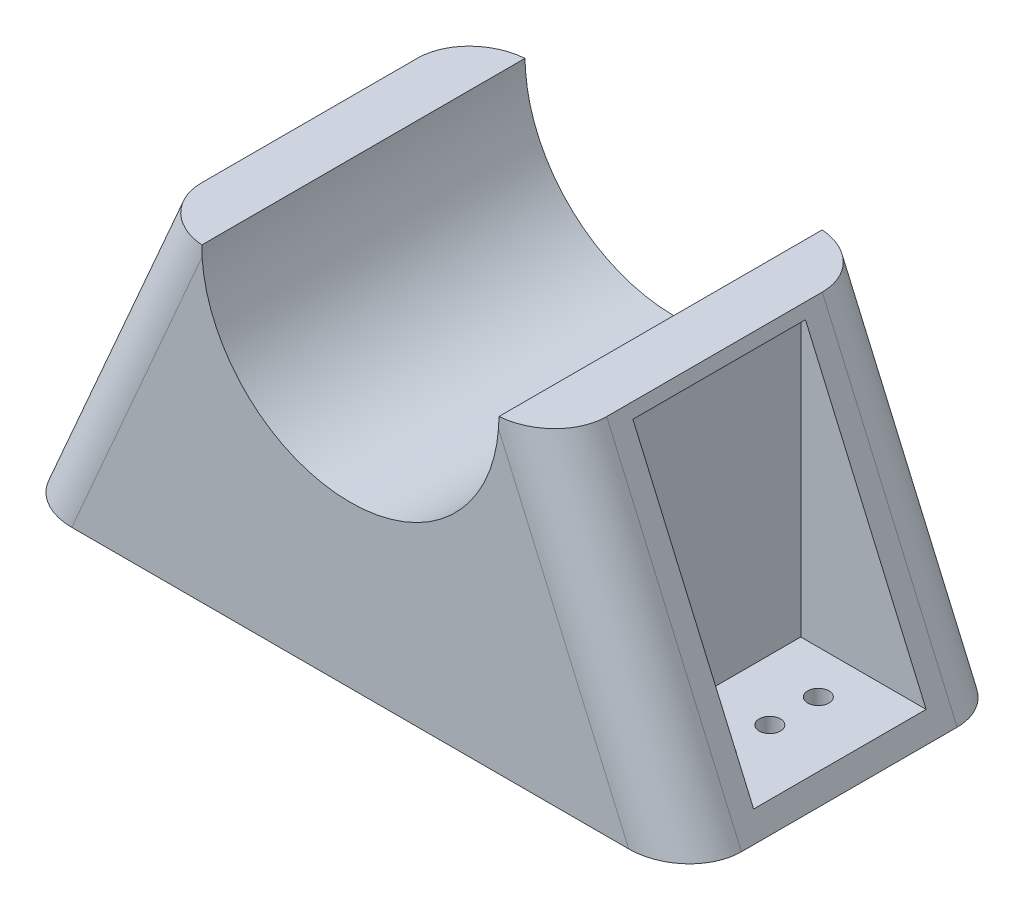
ISO-10303-21;
HEADER;
FILE_DESCRIPTION(('STEP AP214'),'2;1');
FILE_NAME('part.step','',(''),(''),'','','');
FILE_SCHEMA(('AUTOMOTIVE_DESIGN { 1 0 10303 214 1 1 1 1 }'));
ENDSEC;
DATA;
#1=APPLICATION_CONTEXT('core data for automotive mechanical design processes');
#2=APPLICATION_PROTOCOL_DEFINITION('international standard','automotive_design',2000,#1);
#3=PRODUCT_CONTEXT('',#1,'mechanical');
#4=PRODUCT('Part','Part','',(#3));
#5=PRODUCT_RELATED_PRODUCT_CATEGORY('part','',(#4));
#6=PRODUCT_DEFINITION_FORMATION('','',#4);
#7=PRODUCT_DEFINITION_CONTEXT('part definition',#1,'design');
#8=PRODUCT_DEFINITION('design','',#6,#7);
#9=PRODUCT_DEFINITION_SHAPE('','',#8);
#10=(LENGTH_UNIT() NAMED_UNIT(*) SI_UNIT(.MILLI.,.METRE.));
#11=(NAMED_UNIT(*) PLANE_ANGLE_UNIT() SI_UNIT($,.RADIAN.));
#12=(NAMED_UNIT(*) SI_UNIT($,.STERADIAN.) SOLID_ANGLE_UNIT());
#13=UNCERTAINTY_MEASURE_WITH_UNIT(LENGTH_MEASURE(1.E-05),#10,'distance_accuracy_value','');
#14=(GEOMETRIC_REPRESENTATION_CONTEXT(3) GLOBAL_UNCERTAINTY_ASSIGNED_CONTEXT((#13)) GLOBAL_UNIT_ASSIGNED_CONTEXT((#10,
#11,#12)) REPRESENTATION_CONTEXT('',''));
#15=CARTESIAN_POINT('',(0.,0.,0.));
#16=DIRECTION('',(0.,0.,1.));
#17=DIRECTION('',(1.,0.,0.));
#18=AXIS2_PLACEMENT_3D('',#15,#16,#17);
#19=CARTESIAN_POINT('',(-47.7,0.,76.2));
#20=DIRECTION('',(-0.91683450428211,0.399267443899171,0.));
#21=DIRECTION('',(-0.399267443899171,-0.91683450428211,0.));
#22=AXIS2_PLACEMENT_3D('',#19,#20,#21);
#23=PLANE('',#22);
#24=DIRECTION('',(0.,0.,-1.));
#25=VECTOR('',#24,1.);
#26=CARTESIAN_POINT('',(-79.45,-72.9072604234373,76.2));
#27=LINE('',#26,#25);
#28=CARTESIAN_POINT('',(-79.45,-72.9072604234373,63.5));
#29=VERTEX_POINT('',#28);
#30=CARTESIAN_POINT('',(-79.45,-72.9072604234373,12.7));
#31=VERTEX_POINT('',#30);
#32=EDGE_CURVE('E177',#29,#31,#27,.T.);
#33=ORIENTED_EDGE('',*,*,#32,.F.);
#34=DIRECTION('',(0.399267443899171,0.91683450428211,0.));
#35=VECTOR('',#34,1.);
#36=CARTESIAN_POINT('',(-47.7,0.,63.5));
#37=LINE('',#36,#35);
#38=CARTESIAN_POINT('',(-47.7,0.,63.5));
#39=VERTEX_POINT('',#38);
#40=EDGE_CURVE('E439',#29,#39,#37,.T.);
#41=ORIENTED_EDGE('',*,*,#40,.T.);
#42=DIRECTION('',(0.,0.,-1.));
#43=VECTOR('',#42,1.);
#44=CARTESIAN_POINT('',(-47.7,0.,76.2));
#45=LINE('',#44,#43);
#46=CARTESIAN_POINT('',(-47.7,0.,12.7));
#47=VERTEX_POINT('',#46);
#48=EDGE_CURVE('E246',#47,#39,#45,.F.);
#49=ORIENTED_EDGE('',*,*,#48,.F.);
#50=DIRECTION('',(0.399267443899171,0.91683450428211,0.));
#51=VECTOR('',#50,1.);
#52=CARTESIAN_POINT('',(-79.45,-72.9072604234373,12.7));
#53=LINE('',#52,#51);
#54=EDGE_CURVE('E437',#47,#31,#53,.F.);
#55=ORIENTED_EDGE('',*,*,#54,.T.);
#56=EDGE_LOOP('',(#33,#41,#49,#55));
#57=FACE_BOUND('',#56,.T.);
#58=DIRECTION('',(0.,0.,-1.));
#59=VECTOR('',#58,1.);
#60=CARTESIAN_POINT('',(-77.2377374754826,-67.8272604234373,76.2));
#61=LINE('',#60,#59);
#62=CARTESIAN_POINT('',(-77.2377374754826,-67.8272604234373,58.42));
#63=VERTEX_POINT('',#62);
#64=CARTESIAN_POINT('',(-77.2377374754826,-67.8272604234373,17.78));
#65=VERTEX_POINT('',#64);
#66=EDGE_CURVE('E49',#63,#65,#61,.T.);
#67=ORIENTED_EDGE('',*,*,#66,.T.);
#68=DIRECTION('',(0.399267443899171,0.91683450428211,0.));
#69=VECTOR('',#68,1.);
#70=CARTESIAN_POINT('',(-47.7,0.,17.78));
#71=LINE('',#70,#69);
#72=CARTESIAN_POINT('',(-48.8061312622587,-2.54,17.78));
#73=VERTEX_POINT('',#72);
#74=EDGE_CURVE('E11',#65,#73,#71,.T.);
#75=ORIENTED_EDGE('',*,*,#74,.T.);
#76=DIRECTION('',(0.,0.,1.));
#77=VECTOR('',#76,1.);
#78=CARTESIAN_POINT('',(-48.8061312622587,-2.54,76.2));
#79=LINE('',#78,#77);
#80=CARTESIAN_POINT('',(-48.8061312622587,-2.54,58.42));
#81=VERTEX_POINT('',#80);
#82=EDGE_CURVE('E333',#73,#81,#79,.T.);
#83=ORIENTED_EDGE('',*,*,#82,.T.);
#84=DIRECTION('',(-0.399267443899171,-0.91683450428211,0.));
#85=VECTOR('',#84,1.);
#86=CARTESIAN_POINT('',(-47.7,0.,58.42));
#87=LINE('',#86,#85);
#88=EDGE_CURVE('E336',#81,#63,#87,.T.);
#89=ORIENTED_EDGE('',*,*,#88,.T.);
#90=EDGE_LOOP('',(#67,#75,#83,#89));
#91=FACE_BOUND('',#90,.T.);
#92=ADVANCED_FACE('F39',(#57,#91),#23,.T.);
#93=CARTESIAN_POINT('',(79.45,-72.9072604234373,76.2));
#94=DIRECTION('',(0.91683450428211,0.399267443899171,0.));
#95=DIRECTION('',(-0.399267443899171,0.91683450428211,0.));
#96=AXIS2_PLACEMENT_3D('',#93,#94,#95);
#97=PLANE('',#96);
#98=DIRECTION('',(0.,0.,-1.));
#99=VECTOR('',#98,1.);
#100=CARTESIAN_POINT('',(79.45,-72.9072604234373,76.2));
#101=LINE('',#100,#99);
#102=CARTESIAN_POINT('',(79.45,-72.9072604234373,63.5));
#103=VERTEX_POINT('',#102);
#104=CARTESIAN_POINT('',(79.45,-72.9072604234373,12.7));
#105=VERTEX_POINT('',#104);
#106=EDGE_CURVE('E239',#103,#105,#101,.T.);
#107=ORIENTED_EDGE('',*,*,#106,.T.);
#108=DIRECTION('',(0.399267443899171,-0.91683450428211,0.));
#109=VECTOR('',#108,1.);
#110=CARTESIAN_POINT('',(47.7,0.,12.7));
#111=LINE('',#110,#109);
#112=CARTESIAN_POINT('',(47.7,0.,12.7));
#113=VERTEX_POINT('',#112);
#114=EDGE_CURVE('E273',#105,#113,#111,.F.);
#115=ORIENTED_EDGE('',*,*,#114,.T.);
#116=DIRECTION('',(0.,0.,-1.));
#117=VECTOR('',#116,1.);
#118=CARTESIAN_POINT('',(47.7,0.,76.2));
#119=LINE('',#118,#117);
#120=CARTESIAN_POINT('',(47.7,0.,63.5));
#121=VERTEX_POINT('',#120);
#122=EDGE_CURVE('E250',#121,#113,#119,.T.);
#123=ORIENTED_EDGE('',*,*,#122,.F.);
#124=DIRECTION('',(0.399267443899171,-0.91683450428211,0.));
#125=VECTOR('',#124,1.);
#126=CARTESIAN_POINT('',(79.45,-72.9072604234373,63.5));
#127=LINE('',#126,#125);
#128=EDGE_CURVE('E270',#121,#103,#127,.T.);
#129=ORIENTED_EDGE('',*,*,#128,.T.);
#130=EDGE_LOOP('',(#107,#115,#123,#129));
#131=FACE_BOUND('',#130,.T.);
#132=DIRECTION('',(-0.399267443899171,0.91683450428211,0.));
#133=VECTOR('',#132,1.);
#134=CARTESIAN_POINT('',(79.45,-72.9072604234373,58.42));
#135=LINE('',#134,#133);
#136=CARTESIAN_POINT('',(77.2377374754826,-67.8272604234373,58.42));
#137=VERTEX_POINT('',#136);
#138=CARTESIAN_POINT('',(48.8061312622587,-2.53999999999999,58.42));
#139=VERTEX_POINT('',#138);
#140=EDGE_CURVE('E446',#137,#139,#135,.T.);
#141=ORIENTED_EDGE('',*,*,#140,.T.);
#142=DIRECTION('',(0.,0.,-1.));
#143=VECTOR('',#142,1.);
#144=CARTESIAN_POINT('',(48.8061312622587,-2.54000000000001,76.2));
#145=LINE('',#144,#143);
#146=CARTESIAN_POINT('',(48.8061312622587,-2.53999999999997,17.78));
#147=VERTEX_POINT('',#146);
#148=EDGE_CURVE('E442',#139,#147,#145,.T.);
#149=ORIENTED_EDGE('',*,*,#148,.T.);
#150=DIRECTION('',(0.399267443899171,-0.91683450428211,0.));
#151=VECTOR('',#150,1.);
#152=CARTESIAN_POINT('',(79.45,-72.9072604234373,17.78));
#153=LINE('',#152,#151);
#154=CARTESIAN_POINT('',(77.2377374754826,-67.8272604234373,17.78));
#155=VERTEX_POINT('',#154);
#156=EDGE_CURVE('E474',#147,#155,#153,.T.);
#157=ORIENTED_EDGE('',*,*,#156,.T.);
#158=DIRECTION('',(0.,0.,1.));
#159=VECTOR('',#158,1.);
#160=CARTESIAN_POINT('',(77.2377374754826,-67.8272604234373,76.2));
#161=LINE('',#160,#159);
#162=EDGE_CURVE('E476',#155,#137,#161,.T.);
#163=ORIENTED_EDGE('',*,*,#162,.T.);
#164=EDGE_LOOP('',(#141,#149,#157,#163));
#165=FACE_BOUND('',#164,.T.);
#166=ADVANCED_FACE('F370',(#131,#165),#97,.T.);
#167=CARTESIAN_POINT('',(-50.9776999532329,0.,269.88450505913));
#168=DIRECTION('',(0.,1.,0.));
#169=DIRECTION('',(0.,0.,1.));
#170=AXIS2_PLACEMENT_3D('',#167,#168,#169);
#171=PLANE('',#170);
#172=ORIENTED_EDGE('',*,*,#122,.T.);
#173=CARTESIAN_POINT('',(33.8479907871223,0.,12.7));
#174=DIRECTION('',(0.,1.,0.));
#175=DIRECTION('',(-1.,0.,0.));
#176=AXIS2_PLACEMENT_3D('',#173,#174,#175);
#177=ELLIPSE('',#176,13.8520092128778,12.7);
#178=CARTESIAN_POINT('',(35.,0.,0.0439959794991136));
#179=VERTEX_POINT('',#178);
#180=EDGE_CURVE('E277',#113,#179,#177,.T.);
#181=ORIENTED_EDGE('',*,*,#180,.T.);
#182=DIRECTION('',(0.,0.,-1.));
#183=VECTOR('',#182,1.);
#184=CARTESIAN_POINT('',(35.,0.,76.2));
#185=LINE('',#184,#183);
#186=CARTESIAN_POINT('',(35.,0.,76.1560040205009));
#187=VERTEX_POINT('',#186);
#188=EDGE_CURVE('E260',#187,#179,#185,.T.);
#189=ORIENTED_EDGE('',*,*,#188,.F.);
#190=CARTESIAN_POINT('',(33.8479907871223,0.,63.5));
#191=DIRECTION('',(0.,1.,0.));
#192=DIRECTION('',(1.,0.,0.));
#193=AXIS2_PLACEMENT_3D('',#190,#191,#192);
#194=ELLIPSE('',#193,13.8520092128778,12.7);
#195=EDGE_CURVE('E275',#187,#121,#194,.T.);
#196=ORIENTED_EDGE('',*,*,#195,.T.);
#197=EDGE_LOOP('',(#172,#181,#189,#196));
#198=FACE_BOUND('',#197,.T.);
#199=ADVANCED_FACE('F376',(#198),#171,.T.);
#200=CARTESIAN_POINT('',(0.,0.,76.2));
#201=DIRECTION('',(0.,0.,1.));
#202=DIRECTION('',(1.,0.,0.));
#203=AXIS2_PLACEMENT_3D('',#200,#201,#202);
#204=PLANE('',#203);
#205=CARTESIAN_POINT('',(0.,0.,76.2));
#206=DIRECTION('',(0.,0.,1.));
#207=DIRECTION('',(1.,0.,0.));
#208=AXIS2_PLACEMENT_3D('',#205,#206,#207);
#209=CIRCLE('',#208,35.);
#210=CARTESIAN_POINT('',(-34.9142534289852,-2.44845001921529,76.2));
#211=VERTEX_POINT('',#210);
#212=CARTESIAN_POINT('',(34.9142534289852,-2.44845001921527,76.2));
#213=VERTEX_POINT('',#212);
#214=EDGE_CURVE('E254',#211,#213,#209,.T.);
#215=ORIENTED_EDGE('',*,*,#214,.F.);
#216=DIRECTION('',(0.399267443899171,0.91683450428211,0.));
#217=VECTOR('',#216,1.);
#218=CARTESIAN_POINT('',(-28.4521305387712,12.3904689239371,76.2));
#219=LINE('',#218,#217);
#220=CARTESIAN_POINT('',(-65.5979907871222,-72.9072604234373,76.2));
#221=VERTEX_POINT('',#220);
#222=EDGE_CURVE('E319',#211,#221,#219,.F.);
#223=ORIENTED_EDGE('',*,*,#222,.T.);
#224=DIRECTION('',(-1.,0.,0.));
#225=VECTOR('',#224,1.);
#226=CARTESIAN_POINT('',(0.,-72.9072604234373,76.2));
#227=LINE('',#226,#225);
#228=CARTESIAN_POINT('',(65.5979907871223,-72.9072604234373,76.2));
#229=VERTEX_POINT('',#228);
#230=EDGE_CURVE('E243',#229,#221,#227,.T.);
#231=ORIENTED_EDGE('',*,*,#230,.F.);
#232=DIRECTION('',(0.399267443899171,-0.91683450428211,0.));
#233=VECTOR('',#232,1.);
#234=CARTESIAN_POINT('',(28.4521305387712,12.3904689239371,76.2));
#235=LINE('',#234,#233);
#236=EDGE_CURVE('E470',#229,#213,#235,.F.);
#237=ORIENTED_EDGE('',*,*,#236,.T.);
#238=EDGE_LOOP('',(#215,#223,#231,#237));
#239=FACE_BOUND('',#238,.T.);
#240=ADVANCED_FACE('F417',(#239),#204,.T.);
#241=CARTESIAN_POINT('',(0.,0.,0.));
#242=DIRECTION('',(0.,0.,1.));
#243=DIRECTION('',(1.,0.,0.));
#244=AXIS2_PLACEMENT_3D('',#241,#242,#243);
#245=PLANE('',#244);
#246=DIRECTION('',(-1.,0.,0.));
#247=VECTOR('',#246,1.);
#248=CARTESIAN_POINT('',(0.,-72.9072604234373,0.));
#249=LINE('',#248,#247);
#250=CARTESIAN_POINT('',(65.5979907871223,-72.9072604234373,0.));
#251=VERTEX_POINT('',#250);
#252=CARTESIAN_POINT('',(-65.5979907871223,-72.9072604234373,0.));
#253=VERTEX_POINT('',#252);
#254=EDGE_CURVE('E242',#251,#253,#249,.T.);
#255=ORIENTED_EDGE('',*,*,#254,.T.);
#256=DIRECTION('',(0.399267443899171,0.91683450428211,0.));
#257=VECTOR('',#256,1.);
#258=CARTESIAN_POINT('',(-36.0562017956172,-5.07069653751947,0.));
#259=LINE('',#258,#257);
#260=CARTESIAN_POINT('',(-34.9142534289852,-2.44845001921526,0.));
#261=VERTEX_POINT('',#260);
#262=EDGE_CURVE('E330',#253,#261,#259,.T.);
#263=ORIENTED_EDGE('',*,*,#262,.T.);
#264=CARTESIAN_POINT('',(0.,0.,0.));
#265=DIRECTION('',(0.,0.,1.));
#266=DIRECTION('',(1.,0.,0.));
#267=AXIS2_PLACEMENT_3D('',#264,#265,#266);
#268=CIRCLE('',#267,35.);
#269=CARTESIAN_POINT('',(34.9142534289852,-2.44845001921527,0.));
#270=VERTEX_POINT('',#269);
#271=EDGE_CURVE('E253',#261,#270,#268,.T.);
#272=ORIENTED_EDGE('',*,*,#271,.T.);
#273=DIRECTION('',(0.399267443899171,-0.91683450428211,0.));
#274=VECTOR('',#273,1.);
#275=CARTESIAN_POINT('',(67.8062017956172,-77.9779569609568,0.));
#276=LINE('',#275,#274);
#277=EDGE_CURVE('E263',#270,#251,#276,.T.);
#278=ORIENTED_EDGE('',*,*,#277,.T.);
#279=EDGE_LOOP('',(#255,#263,#272,#278));
#280=FACE_BOUND('',#279,.T.);
#281=ADVANCED_FACE('F422',(#280),#245,.F.);
#282=CARTESIAN_POINT('',(0.,0.,76.2));
#283=DIRECTION('',(0.,0.,-1.));
#284=DIRECTION('',(-1.,0.,0.));
#285=AXIS2_PLACEMENT_3D('',#282,#283,#284);
#286=CYLINDRICAL_SURFACE('',#285,35.);
#287=DIRECTION('',(0.,0.,-1.));
#288=VECTOR('',#287,1.);
#289=CARTESIAN_POINT('',(-35.,0.,76.2));
#290=LINE('',#289,#288);
#291=CARTESIAN_POINT('',(-35.,0.,0.0439959794991396));
#292=VERTEX_POINT('',#291);
#293=CARTESIAN_POINT('',(-35.,0.,76.1560040205009));
#294=VERTEX_POINT('',#293);
#295=EDGE_CURVE('E256',#292,#294,#290,.F.);
#296=ORIENTED_EDGE('',*,*,#295,.T.);
#297=CARTESIAN_POINT('',(-35.,0.,76.1560040205009));
#298=CARTESIAN_POINT('',(-35.0000002493644,-0.204170360994433,76.1628061050153));
#299=CARTESIAN_POINT('',(-34.9982134697961,-0.408363935252036,76.1689545938316));
#300=CARTESIAN_POINT('',(-34.991066692675,-0.816651308872302,76.1797480480713));
#301=CARTESIAN_POINT('',(-34.9857080368486,-1.02074511691312,76.1843935770882));
#302=CARTESIAN_POINT('',(-34.9714183184161,-1.42884099374481,76.1919901940467));
#303=CARTESIAN_POINT('',(-34.9624872412537,-1.63284306215849,76.194941275084));
#304=CARTESIAN_POINT('',(-34.9410511594194,-2.04075450378179,76.1989459800358));
#305=CARTESIAN_POINT('',(-34.9285448137084,-2.24466381340013,76.1999988908854));
#306=CARTESIAN_POINT('',(-34.9142534289852,-2.44845001921529,76.2));
#307=B_SPLINE_CURVE_WITH_KNOTS('',3,(#297,#298,#299,#300,#301,#302,#303,#304,#305,#306),
.UNSPECIFIED.,.F.,.F.,(4,2,2,2,4),(0.,0.612844137490721,1.22545819809104,1.83807475488894,
2.450921398761),.UNSPECIFIED.);
#308=EDGE_CURVE('E312',#294,#211,#307,.T.);
#309=ORIENTED_EDGE('',*,*,#308,.T.);
#310=ORIENTED_EDGE('',*,*,#214,.T.);
#311=CARTESIAN_POINT('',(34.9142534289852,-2.44845001921527,76.2));
#312=CARTESIAN_POINT('',(34.9285448137084,-2.24466381340011,76.1999988908854));
#313=CARTESIAN_POINT('',(34.9410511594194,-2.04075450378177,76.1989459800358));
#314=CARTESIAN_POINT('',(34.9624872412537,-1.63284306215847,76.194941275084));
#315=CARTESIAN_POINT('',(34.9714183184161,-1.4288409937448,76.1919901940467));
#316=CARTESIAN_POINT('',(34.9857080368486,-1.02074511691311,76.1843935770882));
#317=CARTESIAN_POINT('',(34.991066692675,-0.816651308872295,76.1797480480713));
#318=CARTESIAN_POINT('',(34.9982134697961,-0.408363935252032,76.1689545938316));
#319=CARTESIAN_POINT('',(35.0000002493644,-0.20417036099443,76.1628061050153));
#320=CARTESIAN_POINT('',(35.,0.,76.1560040205009));
#321=B_SPLINE_CURVE_WITH_KNOTS('',3,(#311,#312,#313,#314,#315,#316,#317,#318,#319,#320),
.UNSPECIFIED.,.F.,.F.,(4,2,2,2,4),(0.,0.612846643872056,1.22546320066995,1.83807726127026,
2.45092139876098),.UNSPECIFIED.);
#322=EDGE_CURVE('E279',#213,#187,#321,.T.);
#323=ORIENTED_EDGE('',*,*,#322,.T.);
#324=ORIENTED_EDGE('',*,*,#188,.T.);
#325=CARTESIAN_POINT('',(35.,0.,0.0439959794991136));
#326=CARTESIAN_POINT('',(35.0000002493644,-0.204170360994431,0.0371938949847051));
#327=CARTESIAN_POINT('',(34.9982134697961,-0.408363935252032,0.0310454061684311));
#328=CARTESIAN_POINT('',(34.991066692675,-0.816651308872295,0.0202519519286606));
#329=CARTESIAN_POINT('',(34.9857080368486,-1.02074511691311,0.0156064229117798));
#330=CARTESIAN_POINT('',(34.9714183184161,-1.4288409937448,0.00800980595328326));
#331=CARTESIAN_POINT('',(34.9624872412537,-1.63284306215847,0.00505872491602579));
#332=CARTESIAN_POINT('',(34.9410511594194,-2.04075450378177,0.00105401996422335));
#333=CARTESIAN_POINT('',(34.9285448137084,-2.24466381340011,1.10911460358849E-06));
#334=CARTESIAN_POINT('',(34.9142534289852,-2.44845001921527,0.));
#335=B_SPLINE_CURVE_WITH_KNOTS('',3,(#325,#326,#327,#328,#329,#330,#331,#332,#333,#334),
.UNSPECIFIED.,.F.,.F.,(4,2,2,2,4),(0.,0.612844137490716,1.22545819809103,1.83807475488892,
2.45092139876098),.UNSPECIFIED.);
#336=EDGE_CURVE('E287',#179,#270,#335,.T.);
#337=ORIENTED_EDGE('',*,*,#336,.T.);
#338=ORIENTED_EDGE('',*,*,#271,.F.);
#339=CARTESIAN_POINT('',(-34.9142534289852,-2.44845001921526,0.));
#340=CARTESIAN_POINT('',(-34.9285448137084,-2.2446638134001,1.10911460180864E-06));
#341=CARTESIAN_POINT('',(-34.9410511594194,-2.04075450378176,0.00105401996422176));
#342=CARTESIAN_POINT('',(-34.9624872412537,-1.63284306215847,0.00505872491602516));
#343=CARTESIAN_POINT('',(-34.9714183184161,-1.42884099374479,0.00800980595328341));
#344=CARTESIAN_POINT('',(-34.9857080368486,-1.02074511691311,0.0156064229117804));
#345=CARTESIAN_POINT('',(-34.991066692675,-0.816651308872292,0.0202519519286608));
#346=CARTESIAN_POINT('',(-34.9982134697961,-0.408363935252031,0.0310454061684268));
#347=CARTESIAN_POINT('',(-35.0000002493644,-0.20417036099443,0.0371938949846966));
#348=CARTESIAN_POINT('',(-35.,0.,0.0439959794990977));
#349=B_SPLINE_CURVE_WITH_KNOTS('',3,(#339,#340,#341,#342,#343,#344,#345,#346,#347,#348),
.UNSPECIFIED.,.F.,.F.,(4,2,2,2,4),(0.,0.612846643872053,1.22546320066994,1.83807726127025,
2.45092139876097),.UNSPECIFIED.);
#350=EDGE_CURVE('E320',#261,#292,#349,.T.);
#351=ORIENTED_EDGE('',*,*,#350,.T.);
#352=EDGE_LOOP('',(#296,#309,#310,#323,#324,#337,#338,#351));
#353=FACE_BOUND('',#352,.T.);
#354=ADVANCED_FACE('F294',(#353),#286,.F.);
#355=ORIENTED_EDGE('',*,*,#48,.T.);
#356=CARTESIAN_POINT('',(-33.8479907871222,0.,63.5));
#357=DIRECTION('',(0.,1.,0.));
#358=DIRECTION('',(1.,0.,0.));
#359=AXIS2_PLACEMENT_3D('',#356,#357,#358);
#360=ELLIPSE('',#359,13.8520092128778,12.7);
#361=EDGE_CURVE('E432',#39,#294,#360,.T.);
#362=ORIENTED_EDGE('',*,*,#361,.T.);
#363=ORIENTED_EDGE('',*,*,#295,.F.);
#364=CARTESIAN_POINT('',(-33.8479907871223,0.,12.7));
#365=DIRECTION('',(0.,1.,0.));
#366=DIRECTION('',(-1.,0.,0.));
#367=AXIS2_PLACEMENT_3D('',#364,#365,#366);
#368=ELLIPSE('',#367,13.8520092128778,12.7);
#369=EDGE_CURVE('E434',#292,#47,#368,.T.);
#370=ORIENTED_EDGE('',*,*,#369,.T.);
#371=EDGE_LOOP('',(#355,#362,#363,#370));
#372=FACE_BOUND('',#371,.T.);
#373=ADVANCED_FACE('F415',(#372),#171,.T.);
#374=CARTESIAN_POINT('',(0.,-72.9072604234373,76.2));
#375=DIRECTION('',(0.,-1.,0.));
#376=DIRECTION('',(0.,0.,-1.));
#377=AXIS2_PLACEMENT_3D('',#374,#375,#376);
#378=PLANE('',#377);
#379=CARTESIAN_POINT('',(-61.9977374754826,-72.9072604234373,38.18));
#380=DIRECTION('',(0.,1.,0.));
#381=DIRECTION('',(0.,0.,1.));
#382=AXIS2_PLACEMENT_3D('',#379,#380,#381);
#383=CIRCLE('',#382,2.5);
#384=CARTESIAN_POINT('',(-61.9977374754826,-72.9072604234373,40.68));
#385=VERTEX_POINT('',#384);
#386=EDGE_CURVE('E341',#385,#385,#383,.T.);
#387=ORIENTED_EDGE('',*,*,#386,.T.);
#388=EDGE_LOOP('',(#387));
#389=FACE_BOUND('',#388,.T.);
#390=CARTESIAN_POINT('',(-61.9977374754826,-72.9072604234373,25.56));
#391=DIRECTION('',(0.,1.,0.));
#392=DIRECTION('',(0.,0.,1.));
#393=AXIS2_PLACEMENT_3D('',#390,#391,#392);
#394=CIRCLE('',#393,2.5);
#395=CARTESIAN_POINT('',(-61.9977374754826,-72.9072604234373,28.06));
#396=VERTEX_POINT('',#395);
#397=EDGE_CURVE('E346',#396,#396,#394,.T.);
#398=ORIENTED_EDGE('',*,*,#397,.T.);
#399=EDGE_LOOP('',(#398));
#400=FACE_BOUND('',#399,.T.);
#401=CARTESIAN_POINT('',(-61.9977374754826,-72.9072604234373,50.8));
#402=DIRECTION('',(0.,1.,0.));
#403=DIRECTION('',(0.,0.,1.));
#404=AXIS2_PLACEMENT_3D('',#401,#402,#403);
#405=CIRCLE('',#404,2.5);
#406=CARTESIAN_POINT('',(-61.9977374754826,-72.9072604234373,53.3));
#407=VERTEX_POINT('',#406);
#408=EDGE_CURVE('E195',#407,#407,#405,.T.);
#409=ORIENTED_EDGE('',*,*,#408,.T.);
#410=EDGE_LOOP('',(#409));
#411=FACE_BOUND('',#410,.T.);
#412=CARTESIAN_POINT('',(61.9977374754826,-72.9072604234373,39.37));
#413=DIRECTION('',(0.,1.,0.));
#414=DIRECTION('',(0.,0.,1.));
#415=AXIS2_PLACEMENT_3D('',#412,#413,#414);
#416=CIRCLE('',#415,2.5);
#417=CARTESIAN_POINT('',(61.9977374754826,-72.9072604234373,41.87));
#418=VERTEX_POINT('',#417);
#419=EDGE_CURVE('E208',#418,#418,#416,.T.);
#420=ORIENTED_EDGE('',*,*,#419,.T.);
#421=EDGE_LOOP('',(#420));
#422=FACE_BOUND('',#421,.T.);
#423=CARTESIAN_POINT('',(61.9977374754826,-72.9072604234373,27.94));
#424=DIRECTION('',(0.,1.,0.));
#425=DIRECTION('',(0.,0.,1.));
#426=AXIS2_PLACEMENT_3D('',#423,#424,#425);
#427=CIRCLE('',#426,2.5);
#428=CARTESIAN_POINT('',(61.9977374754826,-72.9072604234373,30.44));
#429=VERTEX_POINT('',#428);
#430=EDGE_CURVE('E207',#429,#429,#427,.T.);
#431=ORIENTED_EDGE('',*,*,#430,.T.);
#432=EDGE_LOOP('',(#431));
#433=FACE_BOUND('',#432,.T.);
#434=CARTESIAN_POINT('',(61.9977374754826,-72.9072604234373,50.8));
#435=DIRECTION('',(0.,1.,0.));
#436=DIRECTION('',(0.,0.,1.));
#437=AXIS2_PLACEMENT_3D('',#434,#435,#436);
#438=CIRCLE('',#437,2.5);
#439=CARTESIAN_POINT('',(61.9977374754826,-72.9072604234373,53.3));
#440=VERTEX_POINT('',#439);
#441=EDGE_CURVE('E214',#440,#440,#438,.T.);
#442=ORIENTED_EDGE('',*,*,#441,.T.);
#443=EDGE_LOOP('',(#442));
#444=FACE_BOUND('',#443,.T.);
#445=ORIENTED_EDGE('',*,*,#230,.T.);
#446=CARTESIAN_POINT('',(-65.5979907871222,-72.9072604234373,63.5));
#447=DIRECTION('',(0.,-1.,0.));
#448=DIRECTION('',(1.,0.,0.));
#449=AXIS2_PLACEMENT_3D('',#446,#447,#448);
#450=ELLIPSE('',#449,13.8520092128778,12.7);
#451=EDGE_CURVE('E328',#221,#29,#450,.T.);
#452=ORIENTED_EDGE('',*,*,#451,.T.);
#453=ORIENTED_EDGE('',*,*,#32,.T.);
#454=CARTESIAN_POINT('',(-65.5979907871223,-72.9072604234373,12.7));
#455=DIRECTION('',(0.,-1.,0.));
#456=DIRECTION('',(-1.,0.,0.));
#457=AXIS2_PLACEMENT_3D('',#454,#455,#456);
#458=ELLIPSE('',#457,13.8520092128778,12.7);
#459=EDGE_CURVE('E65',#31,#253,#458,.T.);
#460=ORIENTED_EDGE('',*,*,#459,.T.);
#461=ORIENTED_EDGE('',*,*,#254,.F.);
#462=CARTESIAN_POINT('',(65.5979907871223,-72.9072604234373,12.7));
#463=DIRECTION('',(0.,-1.,0.));
#464=DIRECTION('',(-1.,0.,0.));
#465=AXIS2_PLACEMENT_3D('',#462,#463,#464);
#466=ELLIPSE('',#465,13.8520092128778,12.7);
#467=EDGE_CURVE('E268',#251,#105,#466,.T.);
#468=ORIENTED_EDGE('',*,*,#467,.T.);
#469=ORIENTED_EDGE('',*,*,#106,.F.);
#470=CARTESIAN_POINT('',(65.5979907871223,-72.9072604234373,63.5));
#471=DIRECTION('',(0.,-1.,0.));
#472=DIRECTION('',(1.,0.,0.));
#473=AXIS2_PLACEMENT_3D('',#470,#471,#472);
#474=ELLIPSE('',#473,13.8520092128778,12.7);
#475=EDGE_CURVE('E266',#103,#229,#474,.T.);
#476=ORIENTED_EDGE('',*,*,#475,.T.);
#477=EDGE_LOOP('',(#445,#452,#453,#460,#461,#468,#469,#476));
#478=FACE_BOUND('',#477,.T.);
#479=ADVANCED_FACE('F353',(#389,#400,#411,#422,#433,#444,#478),#378,.T.);
#480=CARTESIAN_POINT('',(28.4521305387712,12.3904689239371,12.7));
#481=DIRECTION('',(-0.399267443899171,0.91683450428211,0.));
#482=DIRECTION('',(-0.91683450428211,-0.399267443899171,0.));
#483=AXIS2_PLACEMENT_3D('',#480,#481,#482);
#484=CYLINDRICAL_SURFACE('',#483,12.7);
#485=ORIENTED_EDGE('',*,*,#180,.F.);
#486=ORIENTED_EDGE('',*,*,#114,.F.);
#487=ORIENTED_EDGE('',*,*,#467,.F.);
#488=ORIENTED_EDGE('',*,*,#277,.F.);
#489=ORIENTED_EDGE('',*,*,#336,.F.);
#490=EDGE_LOOP('',(#485,#486,#487,#488,#489));
#491=FACE_BOUND('',#490,.T.);
#492=ADVANCED_FACE('F302',(#491),#484,.T.);
#493=CARTESIAN_POINT('',(67.8062017956172,-77.9779569609568,63.5));
#494=DIRECTION('',(0.399267443899171,-0.91683450428211,0.));
#495=DIRECTION('',(0.91683450428211,0.399267443899171,0.));
#496=AXIS2_PLACEMENT_3D('',#493,#494,#495);
#497=CYLINDRICAL_SURFACE('',#496,12.7);
#498=ORIENTED_EDGE('',*,*,#322,.F.);
#499=ORIENTED_EDGE('',*,*,#236,.F.);
#500=ORIENTED_EDGE('',*,*,#475,.F.);
#501=ORIENTED_EDGE('',*,*,#128,.F.);
#502=ORIENTED_EDGE('',*,*,#195,.F.);
#503=EDGE_LOOP('',(#498,#499,#500,#501,#502));
#504=FACE_BOUND('',#503,.T.);
#505=ADVANCED_FACE('F298',(#504),#497,.T.);
#506=CARTESIAN_POINT('',(149.3,-2.54,58.42));
#507=DIRECTION('',(0.,-1.,0.));
#508=DIRECTION('',(0.,0.,-1.));
#509=AXIS2_PLACEMENT_3D('',#506,#507,#508);
#510=PLANE('',#509);
#511=DIRECTION('',(-1.,0.,0.));
#512=VECTOR('',#511,1.);
#513=CARTESIAN_POINT('',(149.3,-2.54,58.42));
#514=LINE('',#513,#512);
#515=CARTESIAN_POINT('',(47.7,-2.54,58.42));
#516=VERTEX_POINT('',#515);
#517=EDGE_CURVE('E237',#139,#516,#514,.T.);
#518=ORIENTED_EDGE('',*,*,#517,.T.);
#519=DIRECTION('',(0.,0.,1.));
#520=VECTOR('',#519,1.);
#521=CARTESIAN_POINT('',(47.7,-2.54,58.42));
#522=LINE('',#521,#520);
#523=CARTESIAN_POINT('',(47.7,-2.53999999999998,17.78));
#524=VERTEX_POINT('',#523);
#525=EDGE_CURVE('E219',#524,#516,#522,.T.);
#526=ORIENTED_EDGE('',*,*,#525,.F.);
#527=DIRECTION('',(-1.,0.,0.));
#528=VECTOR('',#527,1.);
#529=CARTESIAN_POINT('',(149.3,-2.53999999999998,17.78));
#530=LINE('',#529,#528);
#531=EDGE_CURVE('E231',#147,#524,#530,.T.);
#532=ORIENTED_EDGE('',*,*,#531,.F.);
#533=ORIENTED_EDGE('',*,*,#148,.F.);
#534=EDGE_LOOP('',(#518,#526,#532,#533));
#535=FACE_BOUND('',#534,.T.);
#536=ADVANCED_FACE('F301',(#535),#510,.T.);
#537=CARTESIAN_POINT('',(149.3,-2.54,58.42));
#538=DIRECTION('',(0.,0.,-1.));
#539=DIRECTION('',(0.,1.,0.));
#540=AXIS2_PLACEMENT_3D('',#537,#538,#539);
#541=PLANE('',#540);
#542=DIRECTION('',(-1.,0.,0.));
#543=VECTOR('',#542,1.);
#544=CARTESIAN_POINT('',(149.3,-67.8272604234373,58.42));
#545=LINE('',#544,#543);
#546=CARTESIAN_POINT('',(47.7,-67.8272604234373,58.42));
#547=VERTEX_POINT('',#546);
#548=EDGE_CURVE('E235',#137,#547,#545,.T.);
#549=ORIENTED_EDGE('',*,*,#548,.T.);
#550=DIRECTION('',(0.,-1.,0.));
#551=VECTOR('',#550,1.);
#552=CARTESIAN_POINT('',(47.7,-2.54,58.42));
#553=LINE('',#552,#551);
#554=EDGE_CURVE('E222',#516,#547,#553,.T.);
#555=ORIENTED_EDGE('',*,*,#554,.F.);
#556=ORIENTED_EDGE('',*,*,#517,.F.);
#557=ORIENTED_EDGE('',*,*,#140,.F.);
#558=EDGE_LOOP('',(#549,#555,#556,#557));
#559=FACE_BOUND('',#558,.T.);
#560=ADVANCED_FACE('F406',(#559),#541,.T.);
#561=CARTESIAN_POINT('',(149.3,-67.8272604234373,58.42));
#562=DIRECTION('',(0.,1.,0.));
#563=DIRECTION('',(0.,0.,1.));
#564=AXIS2_PLACEMENT_3D('',#561,#562,#563);
#565=PLANE('',#564);
#566=CARTESIAN_POINT('',(61.9977374754826,-67.8272604234373,39.37));
#567=DIRECTION('',(0.,1.,0.));
#568=DIRECTION('',(0.,0.,1.));
#569=AXIS2_PLACEMENT_3D('',#566,#567,#568);
#570=CIRCLE('',#569,2.5);
#571=CARTESIAN_POINT('',(61.9977374754826,-67.8272604234373,41.87));
#572=VERTEX_POINT('',#571);
#573=EDGE_CURVE('E218',#572,#572,#570,.T.);
#574=ORIENTED_EDGE('',*,*,#573,.F.);
#575=EDGE_LOOP('',(#574));
#576=FACE_BOUND('',#575,.T.);
#577=CARTESIAN_POINT('',(61.9977374754826,-67.8272604234373,27.94));
#578=DIRECTION('',(0.,1.,0.));
#579=DIRECTION('',(0.,0.,1.));
#580=AXIS2_PLACEMENT_3D('',#577,#578,#579);
#581=CIRCLE('',#580,2.5);
#582=CARTESIAN_POINT('',(61.9977374754826,-67.8272604234373,30.44));
#583=VERTEX_POINT('',#582);
#584=EDGE_CURVE('E211',#583,#583,#581,.T.);
#585=ORIENTED_EDGE('',*,*,#584,.F.);
#586=EDGE_LOOP('',(#585));
#587=FACE_BOUND('',#586,.T.);
#588=CARTESIAN_POINT('',(61.9977374754826,-67.8272604234373,50.8));
#589=DIRECTION('',(0.,1.,0.));
#590=DIRECTION('',(0.,0.,1.));
#591=AXIS2_PLACEMENT_3D('',#588,#589,#590);
#592=CIRCLE('',#591,2.5);
#593=CARTESIAN_POINT('',(61.9977374754826,-67.8272604234373,53.3));
#594=VERTEX_POINT('',#593);
#595=EDGE_CURVE('E217',#594,#594,#592,.T.);
#596=ORIENTED_EDGE('',*,*,#595,.F.);
#597=EDGE_LOOP('',(#596));
#598=FACE_BOUND('',#597,.T.);
#599=DIRECTION('',(-1.,0.,0.));
#600=VECTOR('',#599,1.);
#601=CARTESIAN_POINT('',(149.3,-67.8272604234373,17.78));
#602=LINE('',#601,#600);
#603=CARTESIAN_POINT('',(47.7,-67.8272604234373,17.78));
#604=VERTEX_POINT('',#603);
#605=EDGE_CURVE('E233',#155,#604,#602,.T.);
#606=ORIENTED_EDGE('',*,*,#605,.T.);
#607=DIRECTION('',(0.,0.,-1.));
#608=VECTOR('',#607,1.);
#609=CARTESIAN_POINT('',(47.7,-67.8272604234373,58.42));
#610=LINE('',#609,#608);
#611=EDGE_CURVE('E225',#547,#604,#610,.T.);
#612=ORIENTED_EDGE('',*,*,#611,.F.);
#613=ORIENTED_EDGE('',*,*,#548,.F.);
#614=ORIENTED_EDGE('',*,*,#162,.F.);
#615=EDGE_LOOP('',(#606,#612,#613,#614));
#616=FACE_BOUND('',#615,.T.);
#617=ADVANCED_FACE('F402',(#576,#587,#598,#616),#565,.T.);
#618=CARTESIAN_POINT('',(149.3,-2.53999999999998,17.78));
#619=DIRECTION('',(0.,0.,1.));
#620=DIRECTION('',(0.,-1.,0.));
#621=AXIS2_PLACEMENT_3D('',#618,#619,#620);
#622=PLANE('',#621);
#623=ORIENTED_EDGE('',*,*,#531,.T.);
#624=DIRECTION('',(0.,1.,0.));
#625=VECTOR('',#624,1.);
#626=CARTESIAN_POINT('',(47.7,-2.53999999999998,17.78));
#627=LINE('',#626,#625);
#628=EDGE_CURVE('E228',#604,#524,#627,.T.);
#629=ORIENTED_EDGE('',*,*,#628,.F.);
#630=ORIENTED_EDGE('',*,*,#605,.F.);
#631=ORIENTED_EDGE('',*,*,#156,.F.);
#632=EDGE_LOOP('',(#623,#629,#630,#631));
#633=FACE_BOUND('',#632,.T.);
#634=ADVANCED_FACE('F398',(#633),#622,.T.);
#635=CARTESIAN_POINT('',(47.7,0.,0.));
#636=DIRECTION('',(-1.,0.,0.));
#637=DIRECTION('',(0.,0.,1.));
#638=AXIS2_PLACEMENT_3D('',#635,#636,#637);
#639=PLANE('',#638);
#640=ORIENTED_EDGE('',*,*,#525,.T.);
#641=ORIENTED_EDGE('',*,*,#554,.T.);
#642=ORIENTED_EDGE('',*,*,#611,.T.);
#643=ORIENTED_EDGE('',*,*,#628,.T.);
#644=EDGE_LOOP('',(#640,#641,#642,#643));
#645=FACE_BOUND('',#644,.T.);
#646=ADVANCED_FACE('F394',(#645),#639,.F.);
#647=CARTESIAN_POINT('',(61.9977374754826,-72.9072604234373,50.8));
#648=DIRECTION('',(0.,1.,0.));
#649=DIRECTION('',(0.,0.,1.));
#650=AXIS2_PLACEMENT_3D('',#647,#648,#649);
#651=CYLINDRICAL_SURFACE('',#650,2.5);
#652=ORIENTED_EDGE('',*,*,#595,.T.);
#653=EDGE_LOOP('',(#652));
#654=FACE_BOUND('',#653,.T.);
#655=ORIENTED_EDGE('',*,*,#441,.F.);
#656=EDGE_LOOP('',(#655));
#657=FACE_BOUND('',#656,.T.);
#658=ADVANCED_FACE('F390',(#654,#657),#651,.F.);
#659=CARTESIAN_POINT('',(61.9977374754826,-72.9072604234373,27.94));
#660=DIRECTION('',(0.,1.,0.));
#661=DIRECTION('',(0.,0.,1.));
#662=AXIS2_PLACEMENT_3D('',#659,#660,#661);
#663=CYLINDRICAL_SURFACE('',#662,2.5);
#664=ORIENTED_EDGE('',*,*,#584,.T.);
#665=EDGE_LOOP('',(#664));
#666=FACE_BOUND('',#665,.T.);
#667=ORIENTED_EDGE('',*,*,#430,.F.);
#668=EDGE_LOOP('',(#667));
#669=FACE_BOUND('',#668,.T.);
#670=ADVANCED_FACE('F386',(#666,#669),#663,.F.);
#671=CARTESIAN_POINT('',(61.9977374754826,-72.9072604234373,39.37));
#672=DIRECTION('',(0.,1.,0.));
#673=DIRECTION('',(0.,0.,1.));
#674=AXIS2_PLACEMENT_3D('',#671,#672,#673);
#675=CYLINDRICAL_SURFACE('',#674,2.5);
#676=ORIENTED_EDGE('',*,*,#573,.T.);
#677=EDGE_LOOP('',(#676));
#678=FACE_BOUND('',#677,.T.);
#679=ORIENTED_EDGE('',*,*,#419,.F.);
#680=EDGE_LOOP('',(#679));
#681=FACE_BOUND('',#680,.T.);
#682=ADVANCED_FACE('F309',(#678,#681),#675,.F.);
#683=CARTESIAN_POINT('',(-36.0562017956172,-5.07069653751947,63.5));
#684=DIRECTION('',(0.399267443899171,0.91683450428211,0.));
#685=DIRECTION('',(-0.91683450428211,0.399267443899171,0.));
#686=AXIS2_PLACEMENT_3D('',#683,#684,#685);
#687=CYLINDRICAL_SURFACE('',#686,12.7);
#688=ORIENTED_EDGE('',*,*,#451,.F.);
#689=ORIENTED_EDGE('',*,*,#222,.F.);
#690=ORIENTED_EDGE('',*,*,#308,.F.);
#691=ORIENTED_EDGE('',*,*,#361,.F.);
#692=ORIENTED_EDGE('',*,*,#40,.F.);
#693=EDGE_LOOP('',(#688,#689,#690,#691,#692));
#694=FACE_BOUND('',#693,.T.);
#695=ADVANCED_FACE('F306',(#694),#687,.T.);
#696=CARTESIAN_POINT('',(-28.4521305387712,12.3904689239371,12.7));
#697=DIRECTION('',(-0.399267443899171,-0.91683450428211,0.));
#698=DIRECTION('',(0.91683450428211,-0.399267443899171,0.));
#699=AXIS2_PLACEMENT_3D('',#696,#697,#698);
#700=CYLINDRICAL_SURFACE('',#699,12.7);
#701=ORIENTED_EDGE('',*,*,#459,.F.);
#702=ORIENTED_EDGE('',*,*,#54,.F.);
#703=ORIENTED_EDGE('',*,*,#369,.F.);
#704=ORIENTED_EDGE('',*,*,#350,.F.);
#705=ORIENTED_EDGE('',*,*,#262,.F.);
#706=EDGE_LOOP('',(#701,#702,#703,#704,#705));
#707=FACE_BOUND('',#706,.T.);
#708=ADVANCED_FACE('F41',(#707),#700,.T.);
#709=CARTESIAN_POINT('',(-123.9,-2.54,17.78));
#710=DIRECTION('',(0.,0.,1.));
#711=DIRECTION('',(0.,-1.,0.));
#712=AXIS2_PLACEMENT_3D('',#709,#710,#711);
#713=PLANE('',#712);
#714=DIRECTION('',(1.,0.,0.));
#715=VECTOR('',#714,1.);
#716=CARTESIAN_POINT('',(-123.9,-67.8272604234373,17.78));
#717=LINE('',#716,#715);
#718=CARTESIAN_POINT('',(-47.7,-67.8272604234373,17.78));
#719=VERTEX_POINT('',#718);
#720=EDGE_CURVE('E169',#65,#719,#717,.T.);
#721=ORIENTED_EDGE('',*,*,#720,.T.);
#722=DIRECTION('',(0.,-1.,0.));
#723=VECTOR('',#722,1.);
#724=CARTESIAN_POINT('',(-47.7,-2.54,17.78));
#725=LINE('',#724,#723);
#726=CARTESIAN_POINT('',(-47.7,-2.54,17.78));
#727=VERTEX_POINT('',#726);
#728=EDGE_CURVE('E174',#727,#719,#725,.T.);
#729=ORIENTED_EDGE('',*,*,#728,.F.);
#730=DIRECTION('',(1.,0.,0.));
#731=VECTOR('',#730,1.);
#732=CARTESIAN_POINT('',(-123.9,-2.54,17.78));
#733=LINE('',#732,#731);
#734=EDGE_CURVE('E202',#73,#727,#733,.T.);
#735=ORIENTED_EDGE('',*,*,#734,.F.);
#736=ORIENTED_EDGE('',*,*,#74,.F.);
#737=EDGE_LOOP('',(#721,#729,#735,#736));
#738=FACE_BOUND('',#737,.T.);
#739=ADVANCED_FACE('F171',(#738),#713,.T.);
#740=CARTESIAN_POINT('',(-123.9,-67.8272604234373,17.78));
#741=DIRECTION('',(0.,1.,0.));
#742=DIRECTION('',(0.,0.,1.));
#743=AXIS2_PLACEMENT_3D('',#740,#741,#742);
#744=PLANE('',#743);
#745=CARTESIAN_POINT('',(-61.9977374754826,-67.8272604234373,38.18));
#746=DIRECTION('',(0.,1.,0.));
#747=DIRECTION('',(0.,0.,1.));
#748=AXIS2_PLACEMENT_3D('',#745,#746,#747);
#749=CIRCLE('',#748,2.5);
#750=CARTESIAN_POINT('',(-61.9977374754826,-67.8272604234373,40.68));
#751=VERTEX_POINT('',#750);
#752=EDGE_CURVE('E44',#751,#751,#749,.T.);
#753=ORIENTED_EDGE('',*,*,#752,.F.);
#754=EDGE_LOOP('',(#753));
#755=FACE_BOUND('',#754,.T.);
#756=CARTESIAN_POINT('',(-61.9977374754826,-67.8272604234373,25.56));
#757=DIRECTION('',(0.,1.,0.));
#758=DIRECTION('',(0.,0.,1.));
#759=AXIS2_PLACEMENT_3D('',#756,#757,#758);
#760=CIRCLE('',#759,2.5);
#761=CARTESIAN_POINT('',(-61.9977374754826,-67.8272604234373,28.06));
#762=VERTEX_POINT('',#761);
#763=EDGE_CURVE('E339',#762,#762,#760,.T.);
#764=ORIENTED_EDGE('',*,*,#763,.F.);
#765=EDGE_LOOP('',(#764));
#766=FACE_BOUND('',#765,.T.);
#767=CARTESIAN_POINT('',(-61.9977374754826,-67.8272604234373,50.8));
#768=DIRECTION('',(0.,1.,0.));
#769=DIRECTION('',(0.,0.,1.));
#770=AXIS2_PLACEMENT_3D('',#767,#768,#769);
#771=CIRCLE('',#770,2.5);
#772=CARTESIAN_POINT('',(-61.9977374754826,-67.8272604234373,53.3));
#773=VERTEX_POINT('',#772);
#774=EDGE_CURVE('E192',#773,#773,#771,.T.);
#775=ORIENTED_EDGE('',*,*,#774,.F.);
#776=EDGE_LOOP('',(#775));
#777=FACE_BOUND('',#776,.T.);
#778=DIRECTION('',(1.,0.,0.));
#779=VECTOR('',#778,1.);
#780=CARTESIAN_POINT('',(-123.9,-67.8272604234373,58.42));
#781=LINE('',#780,#779);
#782=CARTESIAN_POINT('',(-47.7,-67.8272604234373,58.42));
#783=VERTEX_POINT('',#782);
#784=EDGE_CURVE('E178',#63,#783,#781,.T.);
#785=ORIENTED_EDGE('',*,*,#784,.T.);
#786=DIRECTION('',(0.,0.,1.));
#787=VECTOR('',#786,1.);
#788=CARTESIAN_POINT('',(-47.7,-67.8272604234373,17.78));
#789=LINE('',#788,#787);
#790=EDGE_CURVE('E181',#719,#783,#789,.T.);
#791=ORIENTED_EDGE('',*,*,#790,.F.);
#792=ORIENTED_EDGE('',*,*,#720,.F.);
#793=ORIENTED_EDGE('',*,*,#66,.F.);
#794=EDGE_LOOP('',(#785,#791,#792,#793));
#795=FACE_BOUND('',#794,.T.);
#796=ADVANCED_FACE('F182',(#755,#766,#777,#795),#744,.T.);
#797=CARTESIAN_POINT('',(-123.9,-2.54,58.42));
#798=DIRECTION('',(0.,0.,-1.));
#799=DIRECTION('',(-1.,0.,0.));
#800=AXIS2_PLACEMENT_3D('',#797,#798,#799);
#801=PLANE('',#800);
#802=DIRECTION('',(1.,0.,0.));
#803=VECTOR('',#802,1.);
#804=CARTESIAN_POINT('',(-123.9,-2.54,58.42));
#805=LINE('',#804,#803);
#806=CARTESIAN_POINT('',(-47.7,-2.54,58.42));
#807=VERTEX_POINT('',#806);
#808=EDGE_CURVE('E57',#81,#807,#805,.T.);
#809=ORIENTED_EDGE('',*,*,#808,.T.);
#810=DIRECTION('',(0.,1.,0.));
#811=VECTOR('',#810,1.);
#812=CARTESIAN_POINT('',(-47.7,-2.54,58.42));
#813=LINE('',#812,#811);
#814=EDGE_CURVE('E187',#783,#807,#813,.T.);
#815=ORIENTED_EDGE('',*,*,#814,.F.);
#816=ORIENTED_EDGE('',*,*,#784,.F.);
#817=ORIENTED_EDGE('',*,*,#88,.F.);
#818=EDGE_LOOP('',(#809,#815,#816,#817));
#819=FACE_BOUND('',#818,.T.);
#820=ADVANCED_FACE('F573',(#819),#801,.T.);
#821=CARTESIAN_POINT('',(-123.9,-2.54,17.78));
#822=DIRECTION('',(0.,-1.,0.));
#823=DIRECTION('',(0.,0.,-1.));
#824=AXIS2_PLACEMENT_3D('',#821,#822,#823);
#825=PLANE('',#824);
#826=ORIENTED_EDGE('',*,*,#734,.T.);
#827=DIRECTION('',(0.,0.,-1.));
#828=VECTOR('',#827,1.);
#829=CARTESIAN_POINT('',(-47.7,-2.54,17.78));
#830=LINE('',#829,#828);
#831=EDGE_CURVE('E191',#807,#727,#830,.T.);
#832=ORIENTED_EDGE('',*,*,#831,.F.);
#833=ORIENTED_EDGE('',*,*,#808,.F.);
#834=ORIENTED_EDGE('',*,*,#82,.F.);
#835=EDGE_LOOP('',(#826,#832,#833,#834));
#836=FACE_BOUND('',#835,.T.);
#837=ADVANCED_FACE('F579',(#836),#825,.T.);
#838=CARTESIAN_POINT('',(-47.7,0.,0.));
#839=DIRECTION('',(-1.,0.,0.));
#840=DIRECTION('',(0.,0.,1.));
#841=AXIS2_PLACEMENT_3D('',#838,#839,#840);
#842=PLANE('',#841);
#843=ORIENTED_EDGE('',*,*,#728,.T.);
#844=ORIENTED_EDGE('',*,*,#790,.T.);
#845=ORIENTED_EDGE('',*,*,#814,.T.);
#846=ORIENTED_EDGE('',*,*,#831,.T.);
#847=EDGE_LOOP('',(#843,#844,#845,#846));
#848=FACE_BOUND('',#847,.T.);
#849=ADVANCED_FACE('F190',(#848),#842,.T.);
#850=CARTESIAN_POINT('',(-61.9977374754826,-72.9072604234373,50.8));
#851=DIRECTION('',(0.,1.,0.));
#852=DIRECTION('',(0.,0.,1.));
#853=AXIS2_PLACEMENT_3D('',#850,#851,#852);
#854=CYLINDRICAL_SURFACE('',#853,2.5);
#855=ORIENTED_EDGE('',*,*,#774,.T.);
#856=EDGE_LOOP('',(#855));
#857=FACE_BOUND('',#856,.T.);
#858=ORIENTED_EDGE('',*,*,#408,.F.);
#859=EDGE_LOOP('',(#858));
#860=FACE_BOUND('',#859,.T.);
#861=ADVANCED_FACE('F359',(#857,#860),#854,.F.);
#862=CARTESIAN_POINT('',(-61.9977374754826,-72.9072604234373,25.56));
#863=DIRECTION('',(0.,1.,0.));
#864=DIRECTION('',(0.,0.,1.));
#865=AXIS2_PLACEMENT_3D('',#862,#863,#864);
#866=CYLINDRICAL_SURFACE('',#865,2.5);
#867=ORIENTED_EDGE('',*,*,#763,.T.);
#868=EDGE_LOOP('',(#867));
#869=FACE_BOUND('',#868,.T.);
#870=ORIENTED_EDGE('',*,*,#397,.F.);
#871=EDGE_LOOP('',(#870));
#872=FACE_BOUND('',#871,.T.);
#873=ADVANCED_FACE('F356',(#869,#872),#866,.F.);
#874=CARTESIAN_POINT('',(-61.9977374754826,-72.9072604234373,38.18));
#875=DIRECTION('',(0.,1.,0.));
#876=DIRECTION('',(0.,0.,1.));
#877=AXIS2_PLACEMENT_3D('',#874,#875,#876);
#878=CYLINDRICAL_SURFACE('',#877,2.5);
#879=ORIENTED_EDGE('',*,*,#752,.T.);
#880=EDGE_LOOP('',(#879));
#881=FACE_BOUND('',#880,.T.);
#882=ORIENTED_EDGE('',*,*,#386,.F.);
#883=EDGE_LOOP('',(#882));
#884=FACE_BOUND('',#883,.T.);
#885=ADVANCED_FACE('F358',(#881,#884),#878,.F.);
#886=CLOSED_SHELL('',(#92,#166,#199,#240,#281,#354,#373,#479,#492,#505,#536,#560,#617,#634,#646,
#658,#670,#682,#695,#708,#739,#796,#820,#837,#849,#861,#873,#885));
#887=MANIFOLD_SOLID_BREP('B2',#886);
#888=ADVANCED_BREP_SHAPE_REPRESENTATION('',(#18,#887),#14);
#889=SHAPE_DEFINITION_REPRESENTATION(#9,#888);
ENDSEC;
END-ISO-10303-21;
